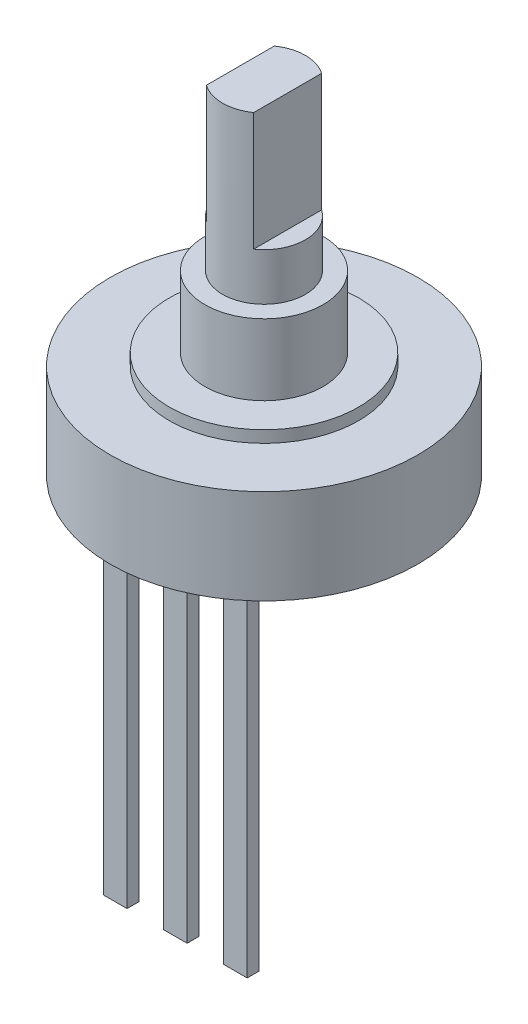
ISO-10303-21;
HEADER;
FILE_DESCRIPTION(('STEP AP214'),'2;1');
FILE_NAME('part.step','',(''),(''),'','','');
FILE_SCHEMA(('AUTOMOTIVE_DESIGN { 1 0 10303 214 1 1 1 1 }'));
ENDSEC;
DATA;
#1=APPLICATION_CONTEXT('core data for automotive mechanical design processes');
#2=APPLICATION_PROTOCOL_DEFINITION('international standard','automotive_design',2000,#1);
#3=PRODUCT_CONTEXT('',#1,'mechanical');
#4=PRODUCT('Part','Part','',(#3));
#5=PRODUCT_RELATED_PRODUCT_CATEGORY('part','',(#4));
#6=PRODUCT_DEFINITION_FORMATION('','',#4);
#7=PRODUCT_DEFINITION_CONTEXT('part definition',#1,'design');
#8=PRODUCT_DEFINITION('design','',#6,#7);
#9=PRODUCT_DEFINITION_SHAPE('','',#8);
#10=(LENGTH_UNIT() NAMED_UNIT(*) SI_UNIT(.MILLI.,.METRE.));
#11=(NAMED_UNIT(*) PLANE_ANGLE_UNIT() SI_UNIT($,.RADIAN.));
#12=(NAMED_UNIT(*) SI_UNIT($,.STERADIAN.) SOLID_ANGLE_UNIT());
#13=UNCERTAINTY_MEASURE_WITH_UNIT(LENGTH_MEASURE(1.E-05),#10,'distance_accuracy_value','');
#14=(GEOMETRIC_REPRESENTATION_CONTEXT(3) GLOBAL_UNCERTAINTY_ASSIGNED_CONTEXT((#13)) GLOBAL_UNIT_ASSIGNED_CONTEXT((#10,
#11,#12)) REPRESENTATION_CONTEXT('',''));
#15=CARTESIAN_POINT('',(0.,0.,0.));
#16=DIRECTION('',(0.,0.,1.));
#17=DIRECTION('',(1.,0.,0.));
#18=AXIS2_PLACEMENT_3D('',#15,#16,#17);
#19=CARTESIAN_POINT('',(0.,-7.5,0.));
#20=DIRECTION('',(0.,-1.,0.));
#21=DIRECTION('',(0.,0.,-1.));
#22=AXIS2_PLACEMENT_3D('',#19,#20,#21);
#23=PLANE('',#22);
#24=DIRECTION('',(1.,0.,0.));
#25=VECTOR('',#24,1.);
#26=CARTESIAN_POINT('',(2.04,-7.5,3.25));
#27=LINE('',#26,#25);
#28=CARTESIAN_POINT('',(2.04,-7.5,3.25));
#29=VERTEX_POINT('',#28);
#30=CARTESIAN_POINT('',(3.04,-7.5,3.25));
#31=VERTEX_POINT('',#30);
#32=EDGE_CURVE('E173',#29,#31,#27,.T.);
#33=ORIENTED_EDGE('',*,*,#32,.F.);
#34=DIRECTION('',(0.,0.,-1.));
#35=VECTOR('',#34,1.);
#36=CARTESIAN_POINT('',(2.04,-7.5,3.75));
#37=LINE('',#36,#35);
#38=CARTESIAN_POINT('',(2.04,-7.5,3.75));
#39=VERTEX_POINT('',#38);
#40=EDGE_CURVE('E170',#39,#29,#37,.T.);
#41=ORIENTED_EDGE('',*,*,#40,.F.);
#42=DIRECTION('',(-1.,0.,0.));
#43=VECTOR('',#42,1.);
#44=CARTESIAN_POINT('',(2.04,-7.5,3.75));
#45=LINE('',#44,#43);
#46=CARTESIAN_POINT('',(3.04,-7.5,3.75));
#47=VERTEX_POINT('',#46);
#48=EDGE_CURVE('E182',#47,#39,#45,.T.);
#49=ORIENTED_EDGE('',*,*,#48,.F.);
#50=DIRECTION('',(0.,0.,1.));
#51=VECTOR('',#50,1.);
#52=CARTESIAN_POINT('',(3.04,-7.5,3.75));
#53=LINE('',#52,#51);
#54=EDGE_CURVE('E190',#31,#47,#53,.T.);
#55=ORIENTED_EDGE('',*,*,#54,.F.);
#56=EDGE_LOOP('',(#33,#41,#49,#55));
#57=FACE_BOUND('',#56,.T.);
#58=CARTESIAN_POINT('',(0.,-7.5,0.));
#59=DIRECTION('',(0.,-1.,0.));
#60=DIRECTION('',(0.,0.,-1.));
#61=AXIS2_PLACEMENT_3D('',#58,#59,#60);
#62=CIRCLE('',#61,6.5);
#63=CARTESIAN_POINT('',(0.,-7.5,-6.5));
#64=VERTEX_POINT('',#63);
#65=EDGE_CURVE('E231',#64,#64,#62,.T.);
#66=ORIENTED_EDGE('',*,*,#65,.T.);
#67=EDGE_LOOP('',(#66));
#68=FACE_BOUND('',#67,.T.);
#69=DIRECTION('',(1.,0.,0.));
#70=VECTOR('',#69,1.);
#71=CARTESIAN_POINT('',(-0.5,-7.5,3.25));
#72=LINE('',#71,#70);
#73=CARTESIAN_POINT('',(-0.5,-7.5,3.25));
#74=VERTEX_POINT('',#73);
#75=CARTESIAN_POINT('',(0.5,-7.5,3.25));
#76=VERTEX_POINT('',#75);
#77=EDGE_CURVE('E215',#74,#76,#72,.T.);
#78=ORIENTED_EDGE('',*,*,#77,.F.);
#79=DIRECTION('',(0.,0.,-1.));
#80=VECTOR('',#79,1.);
#81=CARTESIAN_POINT('',(-0.5,-7.5,3.75));
#82=LINE('',#81,#80);
#83=CARTESIAN_POINT('',(-0.5,-7.5,3.75));
#84=VERTEX_POINT('',#83);
#85=EDGE_CURVE('E201',#84,#74,#82,.T.);
#86=ORIENTED_EDGE('',*,*,#85,.F.);
#87=DIRECTION('',(-1.,0.,0.));
#88=VECTOR('',#87,1.);
#89=CARTESIAN_POINT('',(-0.5,-7.5,3.75));
#90=LINE('',#89,#88);
#91=CARTESIAN_POINT('',(0.5,-7.5,3.75));
#92=VERTEX_POINT('',#91);
#93=EDGE_CURVE('E206',#92,#84,#90,.T.);
#94=ORIENTED_EDGE('',*,*,#93,.F.);
#95=DIRECTION('',(0.,0.,1.));
#96=VECTOR('',#95,1.);
#97=CARTESIAN_POINT('',(0.5,-7.5,3.75));
#98=LINE('',#97,#96);
#99=EDGE_CURVE('E217',#76,#92,#98,.T.);
#100=ORIENTED_EDGE('',*,*,#99,.F.);
#101=EDGE_LOOP('',(#78,#86,#94,#100));
#102=FACE_BOUND('',#101,.T.);
#103=DIRECTION('',(-1.,0.,0.));
#104=VECTOR('',#103,1.);
#105=CARTESIAN_POINT('',(-2.04,-7.5,3.75));
#106=LINE('',#105,#104);
#107=CARTESIAN_POINT('',(-2.04,-7.5,3.75));
#108=VERTEX_POINT('',#107);
#109=CARTESIAN_POINT('',(-3.04,-7.5,3.75));
#110=VERTEX_POINT('',#109);
#111=EDGE_CURVE('E562',#108,#110,#106,.T.);
#112=ORIENTED_EDGE('',*,*,#111,.F.);
#113=DIRECTION('',(0.,0.,1.));
#114=VECTOR('',#113,1.);
#115=CARTESIAN_POINT('',(-2.04,-7.5,3.75));
#116=LINE('',#115,#114);
#117=CARTESIAN_POINT('',(-2.04,-7.5,3.25));
#118=VERTEX_POINT('',#117);
#119=EDGE_CURVE('E168',#118,#108,#116,.T.);
#120=ORIENTED_EDGE('',*,*,#119,.F.);
#121=DIRECTION('',(1.,0.,0.));
#122=VECTOR('',#121,1.);
#123=CARTESIAN_POINT('',(-2.04,-7.5,3.25));
#124=LINE('',#123,#122);
#125=CARTESIAN_POINT('',(-3.04,-7.5,3.25));
#126=VERTEX_POINT('',#125);
#127=EDGE_CURVE('E164',#126,#118,#124,.T.);
#128=ORIENTED_EDGE('',*,*,#127,.F.);
#129=DIRECTION('',(0.,0.,-1.));
#130=VECTOR('',#129,1.);
#131=CARTESIAN_POINT('',(-3.04,-7.5,3.75));
#132=LINE('',#131,#130);
#133=EDGE_CURVE('E559',#110,#126,#132,.T.);
#134=ORIENTED_EDGE('',*,*,#133,.F.);
#135=EDGE_LOOP('',(#112,#120,#128,#134));
#136=FACE_BOUND('',#135,.T.);
#137=ADVANCED_FACE('F31',(#57,#68,#102,#136),#23,.T.);
#138=CARTESIAN_POINT('',(0.,7.,0.));
#139=DIRECTION('',(0.,-1.,0.));
#140=DIRECTION('',(0.,0.,-1.));
#141=AXIS2_PLACEMENT_3D('',#138,#139,#140);
#142=CYLINDRICAL_SURFACE('',#141,1.75);
#143=CARTESIAN_POINT('',(0.,7.,0.));
#144=DIRECTION('',(0.,1.,0.));
#145=DIRECTION('',(0.,0.,1.));
#146=AXIS2_PLACEMENT_3D('',#143,#144,#145);
#147=CIRCLE('',#146,1.75);
#148=CARTESIAN_POINT('',(1.,7.,-1.43614066163451));
#149=VERTEX_POINT('',#148);
#150=CARTESIAN_POINT('',(-1.,7.,-1.43614066163451));
#151=VERTEX_POINT('',#150);
#152=EDGE_CURVE('E269',#149,#151,#147,.T.);
#153=ORIENTED_EDGE('',*,*,#152,.F.);
#154=DIRECTION('',(0.,-1.,0.));
#155=VECTOR('',#154,1.);
#156=CARTESIAN_POINT('',(1.,7.,-1.43614066163451));
#157=LINE('',#156,#155);
#158=CARTESIAN_POINT('',(1.,2.,-1.43614066163451));
#159=VERTEX_POINT('',#158);
#160=EDGE_CURVE('E257',#149,#159,#157,.T.);
#161=ORIENTED_EDGE('',*,*,#160,.T.);
#162=CARTESIAN_POINT('',(0.,2.,0.));
#163=DIRECTION('',(0.,-1.,0.));
#164=DIRECTION('',(0.,0.,-1.));
#165=AXIS2_PLACEMENT_3D('',#162,#163,#164);
#166=CIRCLE('',#165,1.75);
#167=CARTESIAN_POINT('',(1.,2.,1.43614066163451));
#168=VERTEX_POINT('',#167);
#169=EDGE_CURVE('E11',#159,#168,#166,.T.);
#170=ORIENTED_EDGE('',*,*,#169,.T.);
#171=DIRECTION('',(0.,-1.,0.));
#172=VECTOR('',#171,1.);
#173=CARTESIAN_POINT('',(1.,7.,1.43614066163451));
#174=LINE('',#173,#172);
#175=CARTESIAN_POINT('',(1.,7.,1.43614066163451));
#176=VERTEX_POINT('',#175);
#177=EDGE_CURVE('E254',#168,#176,#174,.F.);
#178=ORIENTED_EDGE('',*,*,#177,.T.);
#179=CARTESIAN_POINT('',(-0.999999999999999,7.,1.43614066163451));
#180=VERTEX_POINT('',#179);
#181=EDGE_CURVE('E270',#180,#176,#147,.T.);
#182=ORIENTED_EDGE('',*,*,#181,.F.);
#183=DIRECTION('',(0.,-1.,0.));
#184=VECTOR('',#183,1.);
#185=CARTESIAN_POINT('',(-0.999999999999999,7.,1.43614066163451));
#186=LINE('',#185,#184);
#187=CARTESIAN_POINT('',(-0.999999999999999,2.,1.43614066163451));
#188=VERTEX_POINT('',#187);
#189=EDGE_CURVE('E266',#180,#188,#186,.T.);
#190=ORIENTED_EDGE('',*,*,#189,.T.);
#191=CARTESIAN_POINT('',(0.,2.,0.));
#192=DIRECTION('',(0.,1.,0.));
#193=DIRECTION('',(0.,0.,1.));
#194=AXIS2_PLACEMENT_3D('',#191,#192,#193);
#195=CIRCLE('',#194,1.75);
#196=CARTESIAN_POINT('',(-1.,2.,-1.43614066163451));
#197=VERTEX_POINT('',#196);
#198=EDGE_CURVE('E276',#197,#188,#195,.T.);
#199=ORIENTED_EDGE('',*,*,#198,.F.);
#200=DIRECTION('',(0.,-1.,0.));
#201=VECTOR('',#200,1.);
#202=CARTESIAN_POINT('',(-1.,7.,-1.43614066163451));
#203=LINE('',#202,#201);
#204=EDGE_CURVE('E263',#197,#151,#203,.F.);
#205=ORIENTED_EDGE('',*,*,#204,.T.);
#206=EDGE_LOOP('',(#153,#161,#170,#178,#182,#190,#199,#205));
#207=FACE_BOUND('',#206,.T.);
#208=CARTESIAN_POINT('',(0.,0.,0.));
#209=DIRECTION('',(0.,-1.,0.));
#210=DIRECTION('',(0.,0.,-1.));
#211=AXIS2_PLACEMENT_3D('',#208,#209,#210);
#212=CIRCLE('',#211,1.75);
#213=CARTESIAN_POINT('',(0.,0.,-1.75));
#214=VERTEX_POINT('',#213);
#215=EDGE_CURVE('E246',#214,#214,#212,.T.);
#216=ORIENTED_EDGE('',*,*,#215,.F.);
#217=EDGE_LOOP('',(#216));
#218=FACE_BOUND('',#217,.T.);
#219=ADVANCED_FACE('F33',(#207,#218),#142,.T.);
#220=CARTESIAN_POINT('',(0.,7.,0.));
#221=DIRECTION('',(0.,1.,0.));
#222=DIRECTION('',(0.,0.,1.));
#223=AXIS2_PLACEMENT_3D('',#220,#221,#222);
#224=PLANE('',#223);
#225=DIRECTION('',(0.,0.,1.));
#226=VECTOR('',#225,1.);
#227=CARTESIAN_POINT('',(1.,7.,0.));
#228=LINE('',#227,#226);
#229=EDGE_CURVE('E39',#149,#176,#228,.T.);
#230=ORIENTED_EDGE('',*,*,#229,.F.);
#231=ORIENTED_EDGE('',*,*,#152,.T.);
#232=DIRECTION('',(0.,0.,-1.));
#233=VECTOR('',#232,1.);
#234=CARTESIAN_POINT('',(-1.,7.,0.));
#235=LINE('',#234,#233);
#236=EDGE_CURVE('E273',#180,#151,#235,.T.);
#237=ORIENTED_EDGE('',*,*,#236,.F.);
#238=ORIENTED_EDGE('',*,*,#181,.T.);
#239=EDGE_LOOP('',(#230,#231,#237,#238));
#240=FACE_BOUND('',#239,.T.);
#241=ADVANCED_FACE('F287',(#240),#224,.T.);
#242=CARTESIAN_POINT('',(-2.29059602649007,2.,-2.82596026490066));
#243=DIRECTION('',(0.,1.,0.));
#244=DIRECTION('',(0.,0.,1.));
#245=AXIS2_PLACEMENT_3D('',#242,#243,#244);
#246=PLANE('',#245);
#247=ORIENTED_EDGE('',*,*,#198,.T.);
#248=DIRECTION('',(0.,0.,-1.));
#249=VECTOR('',#248,1.);
#250=CARTESIAN_POINT('',(-1.,2.,-2.82596026490066));
#251=LINE('',#250,#249);
#252=EDGE_CURVE('E260',#188,#197,#251,.T.);
#253=ORIENTED_EDGE('',*,*,#252,.T.);
#254=EDGE_LOOP('',(#247,#253));
#255=FACE_BOUND('',#254,.T.);
#256=ADVANCED_FACE('F293',(#255),#246,.T.);
#257=CARTESIAN_POINT('',(-1.,2.,-2.82596026490066));
#258=DIRECTION('',(1.,0.,0.));
#259=DIRECTION('',(0.,0.,-1.));
#260=AXIS2_PLACEMENT_3D('',#257,#258,#259);
#261=PLANE('',#260);
#262=ORIENTED_EDGE('',*,*,#236,.T.);
#263=ORIENTED_EDGE('',*,*,#204,.F.);
#264=ORIENTED_EDGE('',*,*,#252,.F.);
#265=ORIENTED_EDGE('',*,*,#189,.F.);
#266=EDGE_LOOP('',(#262,#263,#264,#265));
#267=FACE_BOUND('',#266,.T.);
#268=ADVANCED_FACE('F289',(#267),#261,.F.);
#269=CARTESIAN_POINT('',(2.44635761589404,2.,2.04715231788079));
#270=DIRECTION('',(0.,-1.,0.));
#271=DIRECTION('',(0.,0.,-1.));
#272=AXIS2_PLACEMENT_3D('',#269,#270,#271);
#273=PLANE('',#272);
#274=DIRECTION('',(0.,0.,1.));
#275=VECTOR('',#274,1.);
#276=CARTESIAN_POINT('',(1.,2.,-2.55894039735099));
#277=LINE('',#276,#275);
#278=EDGE_CURVE('E251',#159,#168,#277,.T.);
#279=ORIENTED_EDGE('',*,*,#278,.T.);
#280=ORIENTED_EDGE('',*,*,#169,.F.);
#281=EDGE_LOOP('',(#279,#280));
#282=FACE_BOUND('',#281,.T.);
#283=ADVANCED_FACE('F300',(#282),#273,.F.);
#284=CARTESIAN_POINT('',(1.,2.,-2.55894039735099));
#285=DIRECTION('',(-1.,0.,0.));
#286=DIRECTION('',(0.,0.,1.));
#287=AXIS2_PLACEMENT_3D('',#284,#285,#286);
#288=PLANE('',#287);
#289=ORIENTED_EDGE('',*,*,#229,.T.);
#290=ORIENTED_EDGE('',*,*,#177,.F.);
#291=ORIENTED_EDGE('',*,*,#278,.F.);
#292=ORIENTED_EDGE('',*,*,#160,.F.);
#293=EDGE_LOOP('',(#289,#290,#291,#292));
#294=FACE_BOUND('',#293,.T.);
#295=ADVANCED_FACE('F279',(#294),#288,.F.);
#296=CARTESIAN_POINT('',(0.,0.,0.));
#297=DIRECTION('',(0.,-1.,0.));
#298=DIRECTION('',(0.,0.,-1.));
#299=AXIS2_PLACEMENT_3D('',#296,#297,#298);
#300=PLANE('',#299);
#301=CARTESIAN_POINT('',(0.,0.,0.));
#302=DIRECTION('',(0.,-1.,0.));
#303=DIRECTION('',(0.,0.,-1.));
#304=AXIS2_PLACEMENT_3D('',#301,#302,#303);
#305=CIRCLE('',#304,2.5);
#306=CARTESIAN_POINT('',(0.,0.,-2.5));
#307=VERTEX_POINT('',#306);
#308=EDGE_CURVE('E240',#307,#307,#305,.T.);
#309=ORIENTED_EDGE('',*,*,#308,.F.);
#310=EDGE_LOOP('',(#309));
#311=FACE_BOUND('',#310,.T.);
#312=ORIENTED_EDGE('',*,*,#215,.T.);
#313=EDGE_LOOP('',(#312));
#314=FACE_BOUND('',#313,.T.);
#315=ADVANCED_FACE('F332',(#311,#314),#300,.F.);
#316=CARTESIAN_POINT('',(0.,-3.,0.));
#317=DIRECTION('',(0.,1.,0.));
#318=DIRECTION('',(0.,0.,1.));
#319=AXIS2_PLACEMENT_3D('',#316,#317,#318);
#320=CYLINDRICAL_SURFACE('',#319,2.5);
#321=CARTESIAN_POINT('',(0.,-3.,0.));
#322=DIRECTION('',(0.,-1.,0.));
#323=DIRECTION('',(0.,0.,-1.));
#324=AXIS2_PLACEMENT_3D('',#321,#322,#323);
#325=CIRCLE('',#324,2.5);
#326=CARTESIAN_POINT('',(0.,-3.,-2.5));
#327=VERTEX_POINT('',#326);
#328=EDGE_CURVE('E243',#327,#327,#325,.T.);
#329=ORIENTED_EDGE('',*,*,#328,.F.);
#330=EDGE_LOOP('',(#329));
#331=FACE_BOUND('',#330,.T.);
#332=ORIENTED_EDGE('',*,*,#308,.T.);
#333=EDGE_LOOP('',(#332));
#334=FACE_BOUND('',#333,.T.);
#335=ADVANCED_FACE('F327',(#331,#334),#320,.T.);
#336=CARTESIAN_POINT('',(0.,-3.,0.));
#337=DIRECTION('',(0.,-1.,0.));
#338=DIRECTION('',(0.,0.,-1.));
#339=AXIS2_PLACEMENT_3D('',#336,#337,#338);
#340=PLANE('',#339);
#341=CARTESIAN_POINT('',(0.,-3.,0.));
#342=DIRECTION('',(0.,-1.,0.));
#343=DIRECTION('',(0.,0.,-1.));
#344=AXIS2_PLACEMENT_3D('',#341,#342,#343);
#345=CIRCLE('',#344,4.);
#346=CARTESIAN_POINT('',(0.,-3.,-4.));
#347=VERTEX_POINT('',#346);
#348=EDGE_CURVE('E234',#347,#347,#345,.T.);
#349=ORIENTED_EDGE('',*,*,#348,.F.);
#350=EDGE_LOOP('',(#349));
#351=FACE_BOUND('',#350,.T.);
#352=ORIENTED_EDGE('',*,*,#328,.T.);
#353=EDGE_LOOP('',(#352));
#354=FACE_BOUND('',#353,.T.);
#355=ADVANCED_FACE('F324',(#351,#354),#340,.F.);
#356=CARTESIAN_POINT('',(0.,-3.5,0.));
#357=DIRECTION('',(0.,1.,0.));
#358=DIRECTION('',(0.,0.,1.));
#359=AXIS2_PLACEMENT_3D('',#356,#357,#358);
#360=CYLINDRICAL_SURFACE('',#359,4.);
#361=CARTESIAN_POINT('',(0.,-3.5,0.));
#362=DIRECTION('',(0.,-1.,0.));
#363=DIRECTION('',(0.,0.,-1.));
#364=AXIS2_PLACEMENT_3D('',#361,#362,#363);
#365=CIRCLE('',#364,4.);
#366=CARTESIAN_POINT('',(0.,-3.5,-4.));
#367=VERTEX_POINT('',#366);
#368=EDGE_CURVE('E237',#367,#367,#365,.T.);
#369=ORIENTED_EDGE('',*,*,#368,.F.);
#370=EDGE_LOOP('',(#369));
#371=FACE_BOUND('',#370,.T.);
#372=ORIENTED_EDGE('',*,*,#348,.T.);
#373=EDGE_LOOP('',(#372));
#374=FACE_BOUND('',#373,.T.);
#375=ADVANCED_FACE('F319',(#371,#374),#360,.T.);
#376=CARTESIAN_POINT('',(0.,-3.5,0.));
#377=DIRECTION('',(0.,-1.,0.));
#378=DIRECTION('',(0.,0.,-1.));
#379=AXIS2_PLACEMENT_3D('',#376,#377,#378);
#380=PLANE('',#379);
#381=CARTESIAN_POINT('',(0.,-3.5,0.));
#382=DIRECTION('',(0.,-1.,0.));
#383=DIRECTION('',(0.,0.,-1.));
#384=AXIS2_PLACEMENT_3D('',#381,#382,#383);
#385=CIRCLE('',#384,6.5);
#386=CARTESIAN_POINT('',(0.,-3.5,-6.5));
#387=VERTEX_POINT('',#386);
#388=EDGE_CURVE('E230',#387,#387,#385,.T.);
#389=ORIENTED_EDGE('',*,*,#388,.F.);
#390=EDGE_LOOP('',(#389));
#391=FACE_BOUND('',#390,.T.);
#392=ORIENTED_EDGE('',*,*,#368,.T.);
#393=EDGE_LOOP('',(#392));
#394=FACE_BOUND('',#393,.T.);
#395=ADVANCED_FACE('F315',(#391,#394),#380,.F.);
#396=CARTESIAN_POINT('',(0.,-7.5,0.));
#397=DIRECTION('',(0.,1.,0.));
#398=DIRECTION('',(0.,0.,1.));
#399=AXIS2_PLACEMENT_3D('',#396,#397,#398);
#400=CYLINDRICAL_SURFACE('',#399,6.5);
#401=ORIENTED_EDGE('',*,*,#65,.F.);
#402=EDGE_LOOP('',(#401));
#403=FACE_BOUND('',#402,.T.);
#404=ORIENTED_EDGE('',*,*,#388,.T.);
#405=EDGE_LOOP('',(#404));
#406=FACE_BOUND('',#405,.T.);
#407=ADVANCED_FACE('F318',(#403,#406),#400,.T.);
#408=CARTESIAN_POINT('',(-0.5,-22.5,3.75));
#409=DIRECTION('',(1.,0.,0.));
#410=DIRECTION('',(0.,0.,-1.));
#411=AXIS2_PLACEMENT_3D('',#408,#409,#410);
#412=PLANE('',#411);
#413=ORIENTED_EDGE('',*,*,#85,.T.);
#414=DIRECTION('',(0.,1.,0.));
#415=VECTOR('',#414,1.);
#416=CARTESIAN_POINT('',(-0.5,-22.5,3.25));
#417=LINE('',#416,#415);
#418=CARTESIAN_POINT('',(-0.5,-22.5,3.25));
#419=VERTEX_POINT('',#418);
#420=EDGE_CURVE('E228',#419,#74,#417,.T.);
#421=ORIENTED_EDGE('',*,*,#420,.F.);
#422=DIRECTION('',(0.,0.,-1.));
#423=VECTOR('',#422,1.);
#424=CARTESIAN_POINT('',(-0.5,-22.5,3.75));
#425=LINE('',#424,#423);
#426=CARTESIAN_POINT('',(-0.5,-22.5,3.75));
#427=VERTEX_POINT('',#426);
#428=EDGE_CURVE('E202',#427,#419,#425,.T.);
#429=ORIENTED_EDGE('',*,*,#428,.F.);
#430=DIRECTION('',(0.,1.,0.));
#431=VECTOR('',#430,1.);
#432=CARTESIAN_POINT('',(-0.5,-22.5,3.75));
#433=LINE('',#432,#431);
#434=EDGE_CURVE('E212',#427,#84,#433,.T.);
#435=ORIENTED_EDGE('',*,*,#434,.T.);
#436=EDGE_LOOP('',(#413,#421,#429,#435));
#437=FACE_BOUND('',#436,.T.);
#438=ADVANCED_FACE('F313',(#437),#412,.F.);
#439=CARTESIAN_POINT('',(-0.5,-22.5,3.25));
#440=DIRECTION('',(0.,0.,1.));
#441=DIRECTION('',(1.,0.,0.));
#442=AXIS2_PLACEMENT_3D('',#439,#440,#441);
#443=PLANE('',#442);
#444=ORIENTED_EDGE('',*,*,#77,.T.);
#445=DIRECTION('',(0.,1.,0.));
#446=VECTOR('',#445,1.);
#447=CARTESIAN_POINT('',(0.5,-22.5,3.25));
#448=LINE('',#447,#446);
#449=CARTESIAN_POINT('',(0.5,-22.5,3.25));
#450=VERTEX_POINT('',#449);
#451=EDGE_CURVE('E225',#450,#76,#448,.T.);
#452=ORIENTED_EDGE('',*,*,#451,.F.);
#453=DIRECTION('',(1.,0.,0.));
#454=VECTOR('',#453,1.);
#455=CARTESIAN_POINT('',(-0.5,-22.5,3.25));
#456=LINE('',#455,#454);
#457=EDGE_CURVE('E205',#419,#450,#456,.T.);
#458=ORIENTED_EDGE('',*,*,#457,.F.);
#459=ORIENTED_EDGE('',*,*,#420,.T.);
#460=EDGE_LOOP('',(#444,#452,#458,#459));
#461=FACE_BOUND('',#460,.T.);
#462=ADVANCED_FACE('F376',(#461),#443,.F.);
#463=CARTESIAN_POINT('',(0.5,-22.5,3.75));
#464=DIRECTION('',(-1.,0.,0.));
#465=DIRECTION('',(0.,0.,1.));
#466=AXIS2_PLACEMENT_3D('',#463,#464,#465);
#467=PLANE('',#466);
#468=ORIENTED_EDGE('',*,*,#99,.T.);
#469=DIRECTION('',(0.,1.,0.));
#470=VECTOR('',#469,1.);
#471=CARTESIAN_POINT('',(0.5,-22.5,3.75));
#472=LINE('',#471,#470);
#473=CARTESIAN_POINT('',(0.5,-22.5,3.75));
#474=VERTEX_POINT('',#473);
#475=EDGE_CURVE('E223',#474,#92,#472,.T.);
#476=ORIENTED_EDGE('',*,*,#475,.F.);
#477=DIRECTION('',(0.,0.,1.));
#478=VECTOR('',#477,1.);
#479=CARTESIAN_POINT('',(0.5,-22.5,3.75));
#480=LINE('',#479,#478);
#481=EDGE_CURVE('E208',#450,#474,#480,.T.);
#482=ORIENTED_EDGE('',*,*,#481,.F.);
#483=ORIENTED_EDGE('',*,*,#451,.T.);
#484=EDGE_LOOP('',(#468,#476,#482,#483));
#485=FACE_BOUND('',#484,.T.);
#486=ADVANCED_FACE('F383',(#485),#467,.F.);
#487=CARTESIAN_POINT('',(-0.5,-22.5,3.75));
#488=DIRECTION('',(0.,0.,-1.));
#489=DIRECTION('',(-1.,0.,0.));
#490=AXIS2_PLACEMENT_3D('',#487,#488,#489);
#491=PLANE('',#490);
#492=ORIENTED_EDGE('',*,*,#93,.T.);
#493=ORIENTED_EDGE('',*,*,#434,.F.);
#494=DIRECTION('',(-1.,0.,0.));
#495=VECTOR('',#494,1.);
#496=CARTESIAN_POINT('',(-0.5,-22.5,3.75));
#497=LINE('',#496,#495);
#498=EDGE_CURVE('E210',#474,#427,#497,.T.);
#499=ORIENTED_EDGE('',*,*,#498,.F.);
#500=ORIENTED_EDGE('',*,*,#475,.T.);
#501=EDGE_LOOP('',(#492,#493,#499,#500));
#502=FACE_BOUND('',#501,.T.);
#503=ADVANCED_FACE('F390',(#502),#491,.F.);
#504=CARTESIAN_POINT('',(-0.5,-22.5,3.25));
#505=DIRECTION('',(0.,-1.,0.));
#506=DIRECTION('',(0.,0.,-1.));
#507=AXIS2_PLACEMENT_3D('',#504,#505,#506);
#508=PLANE('',#507);
#509=ORIENTED_EDGE('',*,*,#428,.T.);
#510=ORIENTED_EDGE('',*,*,#457,.T.);
#511=ORIENTED_EDGE('',*,*,#481,.T.);
#512=ORIENTED_EDGE('',*,*,#498,.T.);
#513=EDGE_LOOP('',(#509,#510,#511,#512));
#514=FACE_BOUND('',#513,.T.);
#515=ADVANCED_FACE('F398',(#514),#508,.T.);
#516=CARTESIAN_POINT('',(2.04,-22.5,3.75));
#517=DIRECTION('',(1.,0.,0.));
#518=DIRECTION('',(0.,0.,-1.));
#519=AXIS2_PLACEMENT_3D('',#516,#517,#518);
#520=PLANE('',#519);
#521=ORIENTED_EDGE('',*,*,#40,.T.);
#522=DIRECTION('',(0.,1.,0.));
#523=VECTOR('',#522,1.);
#524=CARTESIAN_POINT('',(2.04,-22.5,3.25));
#525=LINE('',#524,#523);
#526=CARTESIAN_POINT('',(2.04,-22.5,3.25));
#527=VERTEX_POINT('',#526);
#528=EDGE_CURVE('E199',#527,#29,#525,.T.);
#529=ORIENTED_EDGE('',*,*,#528,.F.);
#530=DIRECTION('',(0.,0.,-1.));
#531=VECTOR('',#530,1.);
#532=CARTESIAN_POINT('',(2.04,-22.5,3.75));
#533=LINE('',#532,#531);
#534=CARTESIAN_POINT('',(2.04,-22.5,3.75));
#535=VERTEX_POINT('',#534);
#536=EDGE_CURVE('E178',#535,#527,#533,.T.);
#537=ORIENTED_EDGE('',*,*,#536,.F.);
#538=DIRECTION('',(0.,1.,0.));
#539=VECTOR('',#538,1.);
#540=CARTESIAN_POINT('',(2.04,-22.5,3.75));
#541=LINE('',#540,#539);
#542=EDGE_CURVE('E187',#535,#39,#541,.T.);
#543=ORIENTED_EDGE('',*,*,#542,.T.);
#544=EDGE_LOOP('',(#521,#529,#537,#543));
#545=FACE_BOUND('',#544,.T.);
#546=ADVANCED_FACE('F406',(#545),#520,.F.);
#547=CARTESIAN_POINT('',(2.04,-22.5,3.25));
#548=DIRECTION('',(0.,0.,1.));
#549=DIRECTION('',(1.,0.,0.));
#550=AXIS2_PLACEMENT_3D('',#547,#548,#549);
#551=PLANE('',#550);
#552=ORIENTED_EDGE('',*,*,#32,.T.);
#553=DIRECTION('',(0.,1.,0.));
#554=VECTOR('',#553,1.);
#555=CARTESIAN_POINT('',(3.04,-22.5,3.25));
#556=LINE('',#555,#554);
#557=CARTESIAN_POINT('',(3.04,-22.5,3.25));
#558=VERTEX_POINT('',#557);
#559=EDGE_CURVE('E196',#558,#31,#556,.T.);
#560=ORIENTED_EDGE('',*,*,#559,.F.);
#561=DIRECTION('',(1.,0.,0.));
#562=VECTOR('',#561,1.);
#563=CARTESIAN_POINT('',(2.04,-22.5,3.25));
#564=LINE('',#563,#562);
#565=EDGE_CURVE('E181',#527,#558,#564,.T.);
#566=ORIENTED_EDGE('',*,*,#565,.F.);
#567=ORIENTED_EDGE('',*,*,#528,.T.);
#568=EDGE_LOOP('',(#552,#560,#566,#567));
#569=FACE_BOUND('',#568,.T.);
#570=ADVANCED_FACE('F414',(#569),#551,.F.);
#571=CARTESIAN_POINT('',(3.04,-22.5,3.75));
#572=DIRECTION('',(-1.,0.,0.));
#573=DIRECTION('',(0.,0.,1.));
#574=AXIS2_PLACEMENT_3D('',#571,#572,#573);
#575=PLANE('',#574);
#576=ORIENTED_EDGE('',*,*,#54,.T.);
#577=DIRECTION('',(0.,1.,0.));
#578=VECTOR('',#577,1.);
#579=CARTESIAN_POINT('',(3.04,-22.5,3.75));
#580=LINE('',#579,#578);
#581=CARTESIAN_POINT('',(3.04,-22.5,3.75));
#582=VERTEX_POINT('',#581);
#583=EDGE_CURVE('E54',#582,#47,#580,.T.);
#584=ORIENTED_EDGE('',*,*,#583,.F.);
#585=DIRECTION('',(0.,0.,1.));
#586=VECTOR('',#585,1.);
#587=CARTESIAN_POINT('',(3.04,-22.5,3.75));
#588=LINE('',#587,#586);
#589=EDGE_CURVE('E184',#558,#582,#588,.T.);
#590=ORIENTED_EDGE('',*,*,#589,.F.);
#591=ORIENTED_EDGE('',*,*,#559,.T.);
#592=EDGE_LOOP('',(#576,#584,#590,#591));
#593=FACE_BOUND('',#592,.T.);
#594=ADVANCED_FACE('F422',(#593),#575,.F.);
#595=CARTESIAN_POINT('',(2.04,-22.5,3.75));
#596=DIRECTION('',(0.,0.,-1.));
#597=DIRECTION('',(-1.,0.,0.));
#598=AXIS2_PLACEMENT_3D('',#595,#596,#597);
#599=PLANE('',#598);
#600=ORIENTED_EDGE('',*,*,#48,.T.);
#601=ORIENTED_EDGE('',*,*,#542,.F.);
#602=DIRECTION('',(-1.,0.,0.));
#603=VECTOR('',#602,1.);
#604=CARTESIAN_POINT('',(2.04,-22.5,3.75));
#605=LINE('',#604,#603);
#606=EDGE_CURVE('E186',#582,#535,#605,.T.);
#607=ORIENTED_EDGE('',*,*,#606,.F.);
#608=ORIENTED_EDGE('',*,*,#583,.T.);
#609=EDGE_LOOP('',(#600,#601,#607,#608));
#610=FACE_BOUND('',#609,.T.);
#611=ADVANCED_FACE('F430',(#610),#599,.F.);
#612=CARTESIAN_POINT('',(2.04,-22.5,3.25));
#613=DIRECTION('',(0.,-1.,0.));
#614=DIRECTION('',(0.,0.,-1.));
#615=AXIS2_PLACEMENT_3D('',#612,#613,#614);
#616=PLANE('',#615);
#617=ORIENTED_EDGE('',*,*,#536,.T.);
#618=ORIENTED_EDGE('',*,*,#565,.T.);
#619=ORIENTED_EDGE('',*,*,#589,.T.);
#620=ORIENTED_EDGE('',*,*,#606,.T.);
#621=EDGE_LOOP('',(#617,#618,#619,#620));
#622=FACE_BOUND('',#621,.T.);
#623=ADVANCED_FACE('F438',(#622),#616,.T.);
#624=CARTESIAN_POINT('',(-2.04,-22.5,3.75));
#625=DIRECTION('',(-1.,0.,0.));
#626=DIRECTION('',(0.,0.,1.));
#627=AXIS2_PLACEMENT_3D('',#624,#625,#626);
#628=PLANE('',#627);
#629=ORIENTED_EDGE('',*,*,#119,.T.);
#630=DIRECTION('',(0.,1.,0.));
#631=VECTOR('',#630,1.);
#632=CARTESIAN_POINT('',(-2.04,-22.5,3.75));
#633=LINE('',#632,#631);
#634=CARTESIAN_POINT('',(-2.04,-22.5,3.75));
#635=VERTEX_POINT('',#634);
#636=EDGE_CURVE('E149',#635,#108,#633,.T.);
#637=ORIENTED_EDGE('',*,*,#636,.F.);
#638=DIRECTION('',(0.,0.,1.));
#639=VECTOR('',#638,1.);
#640=CARTESIAN_POINT('',(-2.04,-22.5,3.75));
#641=LINE('',#640,#639);
#642=CARTESIAN_POINT('',(-2.04,-22.5,3.25));
#643=VERTEX_POINT('',#642);
#644=EDGE_CURVE('E156',#643,#635,#641,.T.);
#645=ORIENTED_EDGE('',*,*,#644,.F.);
#646=DIRECTION('',(0.,1.,0.));
#647=VECTOR('',#646,1.);
#648=CARTESIAN_POINT('',(-2.04,-22.5,3.25));
#649=LINE('',#648,#647);
#650=EDGE_CURVE('E556',#643,#118,#649,.T.);
#651=ORIENTED_EDGE('',*,*,#650,.T.);
#652=EDGE_LOOP('',(#629,#637,#645,#651));
#653=FACE_BOUND('',#652,.T.);
#654=ADVANCED_FACE('F166',(#653),#628,.F.);
#655=CARTESIAN_POINT('',(-2.04,-22.5,3.75));
#656=DIRECTION('',(0.,0.,-1.));
#657=DIRECTION('',(-1.,0.,0.));
#658=AXIS2_PLACEMENT_3D('',#655,#656,#657);
#659=PLANE('',#658);
#660=ORIENTED_EDGE('',*,*,#111,.T.);
#661=DIRECTION('',(0.,1.,0.));
#662=VECTOR('',#661,1.);
#663=CARTESIAN_POINT('',(-3.04,-22.5,3.75));
#664=LINE('',#663,#662);
#665=CARTESIAN_POINT('',(-3.04,-22.5,3.75));
#666=VERTEX_POINT('',#665);
#667=EDGE_CURVE('E152',#666,#110,#664,.T.);
#668=ORIENTED_EDGE('',*,*,#667,.F.);
#669=DIRECTION('',(-1.,0.,0.));
#670=VECTOR('',#669,1.);
#671=CARTESIAN_POINT('',(-2.04,-22.5,3.75));
#672=LINE('',#671,#670);
#673=EDGE_CURVE('E145',#635,#666,#672,.T.);
#674=ORIENTED_EDGE('',*,*,#673,.F.);
#675=ORIENTED_EDGE('',*,*,#636,.T.);
#676=EDGE_LOOP('',(#660,#668,#674,#675));
#677=FACE_BOUND('',#676,.T.);
#678=ADVANCED_FACE('F147',(#677),#659,.F.);
#679=CARTESIAN_POINT('',(-3.04,-22.5,3.75));
#680=DIRECTION('',(1.,0.,0.));
#681=DIRECTION('',(0.,0.,-1.));
#682=AXIS2_PLACEMENT_3D('',#679,#680,#681);
#683=PLANE('',#682);
#684=ORIENTED_EDGE('',*,*,#133,.T.);
#685=DIRECTION('',(0.,1.,0.));
#686=VECTOR('',#685,1.);
#687=CARTESIAN_POINT('',(-3.04,-22.5,3.25));
#688=LINE('',#687,#686);
#689=CARTESIAN_POINT('',(-3.04,-22.5,3.25));
#690=VERTEX_POINT('',#689);
#691=EDGE_CURVE('E46',#690,#126,#688,.T.);
#692=ORIENTED_EDGE('',*,*,#691,.F.);
#693=DIRECTION('',(0.,0.,-1.));
#694=VECTOR('',#693,1.);
#695=CARTESIAN_POINT('',(-3.04,-22.5,3.75));
#696=LINE('',#695,#694);
#697=EDGE_CURVE('E155',#666,#690,#696,.T.);
#698=ORIENTED_EDGE('',*,*,#697,.F.);
#699=ORIENTED_EDGE('',*,*,#667,.T.);
#700=EDGE_LOOP('',(#684,#692,#698,#699));
#701=FACE_BOUND('',#700,.T.);
#702=ADVANCED_FACE('F458',(#701),#683,.F.);
#703=CARTESIAN_POINT('',(-2.04,-22.5,3.25));
#704=DIRECTION('',(0.,0.,1.));
#705=DIRECTION('',(1.,0.,0.));
#706=AXIS2_PLACEMENT_3D('',#703,#704,#705);
#707=PLANE('',#706);
#708=ORIENTED_EDGE('',*,*,#127,.T.);
#709=ORIENTED_EDGE('',*,*,#650,.F.);
#710=DIRECTION('',(1.,0.,0.));
#711=VECTOR('',#710,1.);
#712=CARTESIAN_POINT('',(-2.04,-22.5,3.25));
#713=LINE('',#712,#711);
#714=EDGE_CURVE('E160',#690,#643,#713,.T.);
#715=ORIENTED_EDGE('',*,*,#714,.F.);
#716=ORIENTED_EDGE('',*,*,#691,.T.);
#717=EDGE_LOOP('',(#708,#709,#715,#716));
#718=FACE_BOUND('',#717,.T.);
#719=ADVANCED_FACE('F465',(#718),#707,.F.);
#720=CARTESIAN_POINT('',(-2.04,-22.5,3.25));
#721=DIRECTION('',(0.,1.,0.));
#722=DIRECTION('',(0.,0.,1.));
#723=AXIS2_PLACEMENT_3D('',#720,#721,#722);
#724=PLANE('',#723);
#725=ORIENTED_EDGE('',*,*,#644,.T.);
#726=ORIENTED_EDGE('',*,*,#673,.T.);
#727=ORIENTED_EDGE('',*,*,#697,.T.);
#728=ORIENTED_EDGE('',*,*,#714,.T.);
#729=EDGE_LOOP('',(#725,#726,#727,#728));
#730=FACE_BOUND('',#729,.T.);
#731=ADVANCED_FACE('F159',(#730),#724,.F.);
#732=CLOSED_SHELL('',(#137,#219,#241,#256,#268,#283,#295,#315,#335,#355,#375,#395,#407,#438,
#462,#486,#503,#515,#546,#570,#594,#611,#623,#654,#678,#702,#719,#731));
#733=MANIFOLD_SOLID_BREP('B2',#732);
#734=ADVANCED_BREP_SHAPE_REPRESENTATION('',(#18,#733),#14);
#735=SHAPE_DEFINITION_REPRESENTATION(#9,#734);
ENDSEC;
END-ISO-10303-21;
